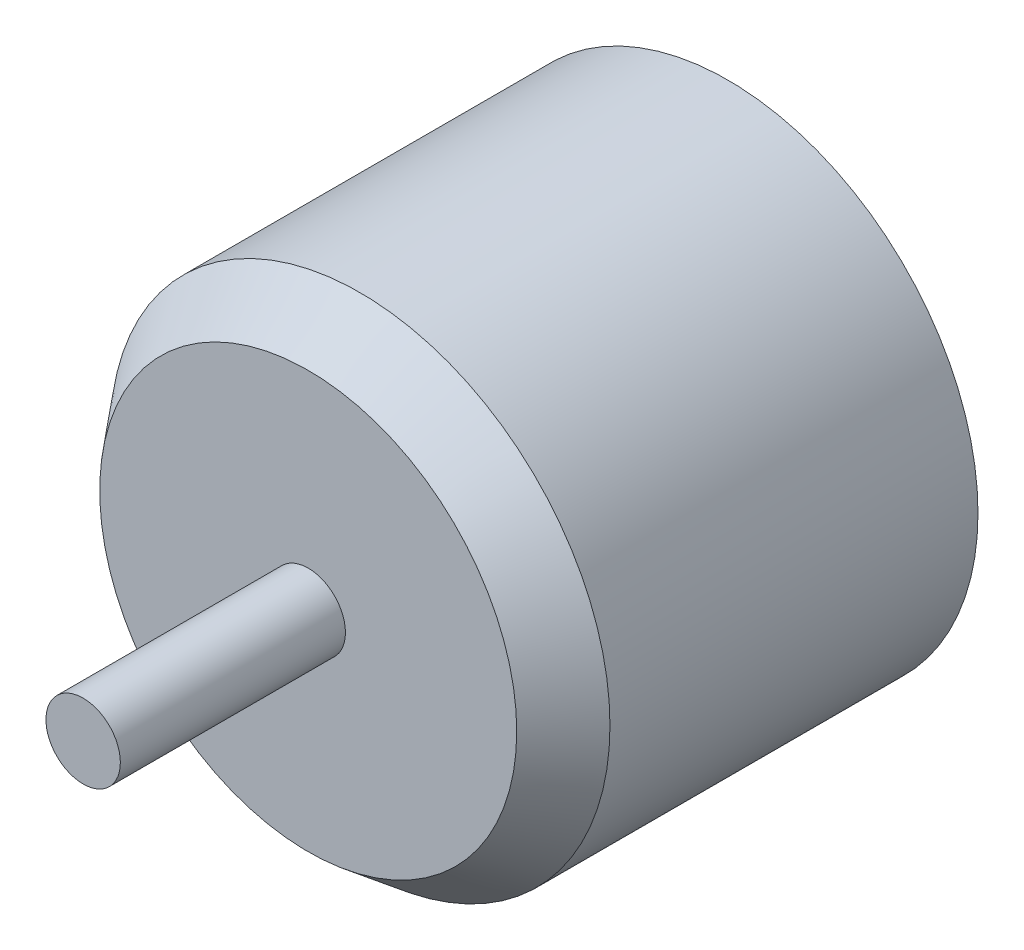
ISO-10303-21;
HEADER;
FILE_DESCRIPTION(('STEP AP214'),'2;1');
FILE_NAME('part.step','',(''),(''),'','','');
FILE_SCHEMA(('AUTOMOTIVE_DESIGN { 1 0 10303 214 1 1 1 1 }'));
ENDSEC;
DATA;
#1=APPLICATION_CONTEXT('core data for automotive mechanical design processes');
#2=APPLICATION_PROTOCOL_DEFINITION('international standard','automotive_design',2000,#1);
#3=PRODUCT_CONTEXT('',#1,'mechanical');
#4=PRODUCT('Part','Part','',(#3));
#5=PRODUCT_RELATED_PRODUCT_CATEGORY('part','',(#4));
#6=PRODUCT_DEFINITION_FORMATION('','',#4);
#7=PRODUCT_DEFINITION_CONTEXT('part definition',#1,'design');
#8=PRODUCT_DEFINITION('design','',#6,#7);
#9=PRODUCT_DEFINITION_SHAPE('','',#8);
#10=(LENGTH_UNIT() NAMED_UNIT(*) SI_UNIT(.MILLI.,.METRE.));
#11=(NAMED_UNIT(*) PLANE_ANGLE_UNIT() SI_UNIT($,.RADIAN.));
#12=(NAMED_UNIT(*) SI_UNIT($,.STERADIAN.) SOLID_ANGLE_UNIT());
#13=UNCERTAINTY_MEASURE_WITH_UNIT(LENGTH_MEASURE(1.E-05),#10,'distance_accuracy_value','');
#14=(GEOMETRIC_REPRESENTATION_CONTEXT(3) GLOBAL_UNCERTAINTY_ASSIGNED_CONTEXT((#13)) GLOBAL_UNIT_ASSIGNED_CONTEXT((#10,
#11,#12)) REPRESENTATION_CONTEXT('',''));
#15=CARTESIAN_POINT('',(0.,0.,0.));
#16=DIRECTION('',(0.,0.,1.));
#17=DIRECTION('',(1.,0.,0.));
#18=AXIS2_PLACEMENT_3D('',#15,#16,#17);
#19=CARTESIAN_POINT('',(0.,4.,24.2));
#20=DIRECTION('',(0.,0.,-1.));
#21=DIRECTION('',(-1.,0.,0.));
#22=AXIS2_PLACEMENT_3D('',#19,#20,#21);
#23=PLANE('',#22);
#24=CARTESIAN_POINT('',(0.,0.,24.2));
#25=DIRECTION('',(0.,0.,1.));
#26=DIRECTION('',(1.,0.,0.));
#27=AXIS2_PLACEMENT_3D('',#24,#25,#26);
#28=CIRCLE('',#27,4.);
#29=CARTESIAN_POINT('',(4.,0.,24.2));
#30=VERTEX_POINT('',#29);
#31=EDGE_CURVE('E59',#30,#30,#28,.T.);
#32=ORIENTED_EDGE('',*,*,#31,.T.);
#33=EDGE_LOOP('',(#32));
#34=FACE_BOUND('',#33,.T.);
#35=ADVANCED_FACE('F31',(#34),#23,.F.);
#36=CARTESIAN_POINT('',(0.,0.,-55.));
#37=DIRECTION('',(0.,0.,1.));
#38=DIRECTION('',(1.,0.,0.));
#39=AXIS2_PLACEMENT_3D('',#36,#37,#38);
#40=PLANE('',#39);
#41=CARTESIAN_POINT('',(0.,0.,-55.));
#42=DIRECTION('',(0.,0.,1.));
#43=DIRECTION('',(1.,0.,0.));
#44=AXIS2_PLACEMENT_3D('',#41,#42,#43);
#45=CIRCLE('',#44,8.96062500000002);
#46=CARTESIAN_POINT('',(8.96062500000002,0.,-55.));
#47=VERTEX_POINT('',#46);
#48=EDGE_CURVE('E10',#47,#47,#45,.T.);
#49=ORIENTED_EDGE('',*,*,#48,.F.);
#50=EDGE_LOOP('',(#49));
#51=FACE_BOUND('',#50,.T.);
#52=ADVANCED_FACE('F101',(#51),#40,.F.);
#53=CARTESIAN_POINT('',(0.,0.,67.9640625));
#54=DIRECTION('',(0.,0.,1.));
#55=DIRECTION('',(1.,0.,0.));
#56=AXIS2_PLACEMENT_3D('',#53,#54,#55);
#57=CYLINDRICAL_SURFACE('',#56,8.96062500000002);
#58=CARTESIAN_POINT('',(0.,0.,-48.6));
#59=DIRECTION('',(0.,0.,1.));
#60=DIRECTION('',(1.,0.,0.));
#61=AXIS2_PLACEMENT_3D('',#58,#59,#60);
#62=CIRCLE('',#61,8.96062500000002);
#63=CARTESIAN_POINT('',(8.96062500000002,0.,-48.6));
#64=VERTEX_POINT('',#63);
#65=EDGE_CURVE('E37',#64,#64,#62,.T.);
#66=ORIENTED_EDGE('',*,*,#65,.F.);
#67=EDGE_LOOP('',(#66));
#68=FACE_BOUND('',#67,.T.);
#69=ORIENTED_EDGE('',*,*,#48,.T.);
#70=EDGE_LOOP('',(#69));
#71=FACE_BOUND('',#70,.T.);
#72=ADVANCED_FACE('F96',(#68,#71),#57,.T.);
#73=CARTESIAN_POINT('',(0.,8.96062500000002,-48.6));
#74=DIRECTION('',(0.,0.,1.));
#75=DIRECTION('',(1.,0.,0.));
#76=AXIS2_PLACEMENT_3D('',#73,#74,#75);
#77=PLANE('',#76);
#78=CARTESIAN_POINT('',(0.,0.,-48.6));
#79=DIRECTION('',(0.,0.,1.));
#80=DIRECTION('',(1.,0.,0.));
#81=AXIS2_PLACEMENT_3D('',#78,#79,#80);
#82=CIRCLE('',#81,18.77175);
#83=CARTESIAN_POINT('',(18.77175,0.,-48.6));
#84=VERTEX_POINT('',#83);
#85=EDGE_CURVE('E41',#84,#84,#82,.T.);
#86=ORIENTED_EDGE('',*,*,#85,.F.);
#87=EDGE_LOOP('',(#86));
#88=FACE_BOUND('',#87,.T.);
#89=ORIENTED_EDGE('',*,*,#65,.T.);
#90=EDGE_LOOP('',(#89));
#91=FACE_BOUND('',#90,.T.);
#92=ADVANCED_FACE('F91',(#88,#91),#77,.F.);
#93=CARTESIAN_POINT('',(0.,0.,-48.6));
#94=DIRECTION('',(0.,0.,1.));
#95=DIRECTION('',(1.,0.,0.));
#96=AXIS2_PLACEMENT_3D('',#93,#94,#95);
#97=CONICAL_SURFACE('',#96,18.77175,1.16582593077921);
#98=CARTESIAN_POINT('',(0.,0.,-45.123477484472));
#99=DIRECTION('',(0.,0.,1.));
#100=DIRECTION('',(1.,0.,0.));
#101=AXIS2_PLACEMENT_3D('',#98,#99,#100);
#102=CIRCLE('',#101,26.881875);
#103=CARTESIAN_POINT('',(26.881875,0.,-45.123477484472));
#104=VERTEX_POINT('',#103);
#105=EDGE_CURVE('E45',#104,#104,#102,.T.);
#106=ORIENTED_EDGE('',*,*,#105,.F.);
#107=EDGE_LOOP('',(#106));
#108=FACE_BOUND('',#107,.T.);
#109=ORIENTED_EDGE('',*,*,#85,.T.);
#110=EDGE_LOOP('',(#109));
#111=FACE_BOUND('',#110,.T.);
#112=ADVANCED_FACE('F85',(#108,#111),#97,.T.);
#113=CARTESIAN_POINT('',(0.,0.,67.9640625));
#114=DIRECTION('',(0.,0.,1.));
#115=DIRECTION('',(1.,0.,0.));
#116=AXIS2_PLACEMENT_3D('',#113,#114,#115);
#117=CYLINDRICAL_SURFACE('',#116,26.881875);
#118=CARTESIAN_POINT('',(0.,0.,-5.55862499999998));
#119=DIRECTION('',(0.,0.,1.));
#120=DIRECTION('',(1.,0.,0.));
#121=AXIS2_PLACEMENT_3D('',#118,#119,#120);
#122=CIRCLE('',#121,26.881875);
#123=CARTESIAN_POINT('',(26.881875,0.,-5.55862499999998));
#124=VERTEX_POINT('',#123);
#125=EDGE_CURVE('E50',#124,#124,#122,.T.);
#126=ORIENTED_EDGE('',*,*,#125,.F.);
#127=EDGE_LOOP('',(#126));
#128=FACE_BOUND('',#127,.T.);
#129=ORIENTED_EDGE('',*,*,#105,.T.);
#130=EDGE_LOOP('',(#129));
#131=FACE_BOUND('',#130,.T.);
#132=ADVANCED_FACE('F79',(#128,#131),#117,.T.);
#133=CARTESIAN_POINT('',(0.,0.,-5.55862499999998));
#134=DIRECTION('',(0.,0.,-1.));
#135=DIRECTION('',(-1.,0.,0.));
#136=AXIS2_PLACEMENT_3D('',#133,#134,#135);
#137=CONICAL_SURFACE('',#136,26.881875,0.676736947556861);
#138=CARTESIAN_POINT('',(0.,0.,0.));
#139=DIRECTION('',(0.,0.,1.));
#140=DIRECTION('',(1.,0.,0.));
#141=AXIS2_PLACEMENT_3D('',#138,#139,#140);
#142=CIRCLE('',#141,22.41675);
#143=CARTESIAN_POINT('',(22.41675,0.,0.));
#144=VERTEX_POINT('',#143);
#145=EDGE_CURVE('E53',#144,#144,#142,.T.);
#146=ORIENTED_EDGE('',*,*,#145,.F.);
#147=EDGE_LOOP('',(#146));
#148=FACE_BOUND('',#147,.T.);
#149=ORIENTED_EDGE('',*,*,#125,.T.);
#150=EDGE_LOOP('',(#149));
#151=FACE_BOUND('',#150,.T.);
#152=ADVANCED_FACE('F73',(#148,#151),#137,.T.);
#153=CARTESIAN_POINT('',(0.,22.41675,0.));
#154=DIRECTION('',(0.,0.,-1.));
#155=DIRECTION('',(-1.,0.,0.));
#156=AXIS2_PLACEMENT_3D('',#153,#154,#155);
#157=PLANE('',#156);
#158=CARTESIAN_POINT('',(0.,0.,0.));
#159=DIRECTION('',(0.,0.,1.));
#160=DIRECTION('',(1.,0.,0.));
#161=AXIS2_PLACEMENT_3D('',#158,#159,#160);
#162=CIRCLE('',#161,4.00000000000001);
#163=CARTESIAN_POINT('',(4.00000000000001,0.,0.));
#164=VERTEX_POINT('',#163);
#165=EDGE_CURVE('E56',#164,#164,#162,.T.);
#166=ORIENTED_EDGE('',*,*,#165,.F.);
#167=EDGE_LOOP('',(#166));
#168=FACE_BOUND('',#167,.T.);
#169=ORIENTED_EDGE('',*,*,#145,.T.);
#170=EDGE_LOOP('',(#169));
#171=FACE_BOUND('',#170,.T.);
#172=ADVANCED_FACE('F67',(#168,#171),#157,.F.);
#173=CARTESIAN_POINT('',(0.,0.,67.9640625));
#174=DIRECTION('',(0.,0.,1.));
#175=DIRECTION('',(1.,0.,0.));
#176=AXIS2_PLACEMENT_3D('',#173,#174,#175);
#177=CYLINDRICAL_SURFACE('',#176,4.00000000000001);
#178=ORIENTED_EDGE('',*,*,#31,.F.);
#179=EDGE_LOOP('',(#178));
#180=FACE_BOUND('',#179,.T.);
#181=ORIENTED_EDGE('',*,*,#165,.T.);
#182=EDGE_LOOP('',(#181));
#183=FACE_BOUND('',#182,.T.);
#184=ADVANCED_FACE('F64',(#180,#183),#177,.T.);
#185=CLOSED_SHELL('',(#35,#52,#72,#92,#112,#132,#152,#172,#184));
#186=MANIFOLD_SOLID_BREP('B2',#185);
#187=ADVANCED_BREP_SHAPE_REPRESENTATION('',(#18,#186),#14);
#188=SHAPE_DEFINITION_REPRESENTATION(#9,#187);
ENDSEC;
END-ISO-10303-21;
